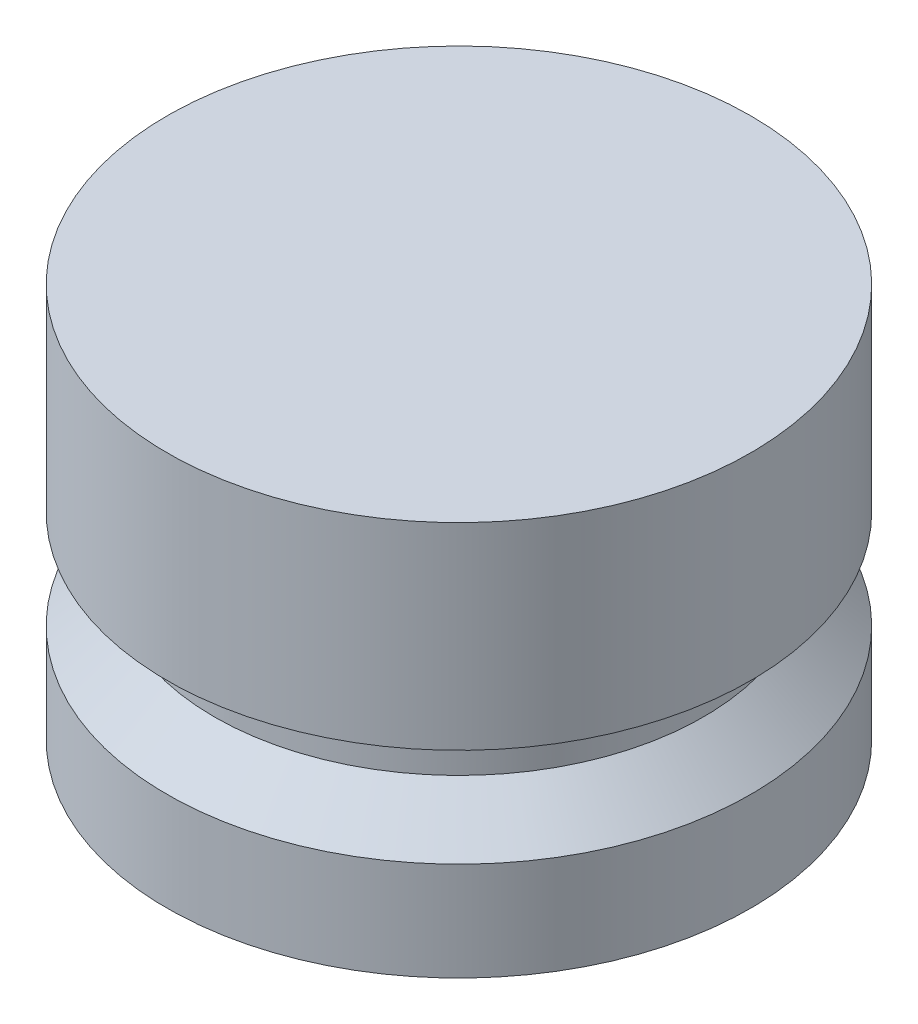
ISO-10303-21;
HEADER;
FILE_DESCRIPTION(('STEP AP214'),'2;1');
FILE_NAME('part.step','',(''),(''),'','','');
FILE_SCHEMA(('AUTOMOTIVE_DESIGN { 1 0 10303 214 1 1 1 1 }'));
ENDSEC;
DATA;
#1=APPLICATION_CONTEXT('core data for automotive mechanical design processes');
#2=APPLICATION_PROTOCOL_DEFINITION('international standard','automotive_design',2000,#1);
#3=PRODUCT_CONTEXT('',#1,'mechanical');
#4=PRODUCT('Part','Part','',(#3));
#5=PRODUCT_RELATED_PRODUCT_CATEGORY('part','',(#4));
#6=PRODUCT_DEFINITION_FORMATION('','',#4);
#7=PRODUCT_DEFINITION_CONTEXT('part definition',#1,'design');
#8=PRODUCT_DEFINITION('design','',#6,#7);
#9=PRODUCT_DEFINITION_SHAPE('','',#8);
#10=(LENGTH_UNIT() NAMED_UNIT(*) SI_UNIT(.MILLI.,.METRE.));
#11=(NAMED_UNIT(*) PLANE_ANGLE_UNIT() SI_UNIT($,.RADIAN.));
#12=(NAMED_UNIT(*) SI_UNIT($,.STERADIAN.) SOLID_ANGLE_UNIT());
#13=UNCERTAINTY_MEASURE_WITH_UNIT(LENGTH_MEASURE(1.E-05),#10,'distance_accuracy_value','');
#14=(GEOMETRIC_REPRESENTATION_CONTEXT(3) GLOBAL_UNCERTAINTY_ASSIGNED_CONTEXT((#13)) GLOBAL_UNIT_ASSIGNED_CONTEXT((#10,
#11,#12)) REPRESENTATION_CONTEXT('',''));
#15=CARTESIAN_POINT('',(0.,0.,0.));
#16=DIRECTION('',(0.,0.,1.));
#17=DIRECTION('',(1.,0.,0.));
#18=AXIS2_PLACEMENT_3D('',#15,#16,#17);
#19=CARTESIAN_POINT('',(0.,0.,0.));
#20=DIRECTION('',(0.,1.,0.));
#21=DIRECTION('',(0.,0.,1.));
#22=AXIS2_PLACEMENT_3D('',#19,#20,#21);
#23=PLANE('',#22);
#24=CARTESIAN_POINT('',(0.,0.,0.));
#25=DIRECTION('',(0.,-1.,0.));
#26=DIRECTION('',(0.,0.,-1.));
#27=AXIS2_PLACEMENT_3D('',#24,#25,#26);
#28=CIRCLE('',#27,9.398);
#29=CARTESIAN_POINT('',(0.,0.,-9.398));
#30=VERTEX_POINT('',#29);
#31=EDGE_CURVE('E10',#30,#30,#28,.T.);
#32=ORIENTED_EDGE('',*,*,#31,.T.);
#33=EDGE_LOOP('',(#32));
#34=FACE_BOUND('',#33,.T.);
#35=ADVANCED_FACE('F31',(#34),#23,.F.);
#36=CARTESIAN_POINT('',(0.,0.,0.));
#37=DIRECTION('',(0.,-1.,0.));
#38=DIRECTION('',(0.,0.,-1.));
#39=AXIS2_PLACEMENT_3D('',#36,#37,#38);
#40=CYLINDRICAL_SURFACE('',#39,9.398);
#41=ORIENTED_EDGE('',*,*,#31,.F.);
#42=EDGE_LOOP('',(#41));
#43=FACE_BOUND('',#42,.T.);
#44=CARTESIAN_POINT('',(0.,3.175,0.));
#45=DIRECTION('',(0.,-1.,0.));
#46=DIRECTION('',(0.,0.,-1.));
#47=AXIS2_PLACEMENT_3D('',#44,#45,#46);
#48=CIRCLE('',#47,9.398);
#49=CARTESIAN_POINT('',(0.,3.175,-9.398));
#50=VERTEX_POINT('',#49);
#51=EDGE_CURVE('E37',#50,#50,#48,.T.);
#52=ORIENTED_EDGE('',*,*,#51,.T.);
#53=EDGE_LOOP('',(#52));
#54=FACE_BOUND('',#53,.T.);
#55=ADVANCED_FACE('F69',(#43,#54),#40,.T.);
#56=CARTESIAN_POINT('',(0.,4.572,0.));
#57=DIRECTION('',(0.,-1.,0.));
#58=DIRECTION('',(0.,0.,-1.));
#59=AXIS2_PLACEMENT_3D('',#56,#57,#58);
#60=CONICAL_SURFACE('',#59,7.874,0.82884905878898);
#61=ORIENTED_EDGE('',*,*,#51,.F.);
#62=EDGE_LOOP('',(#61));
#63=FACE_BOUND('',#62,.T.);
#64=CARTESIAN_POINT('',(0.,4.572,0.));
#65=DIRECTION('',(0.,-1.,0.));
#66=DIRECTION('',(0.,0.,-1.));
#67=AXIS2_PLACEMENT_3D('',#64,#65,#66);
#68=CIRCLE('',#67,7.874);
#69=CARTESIAN_POINT('',(0.,4.572,-7.874));
#70=VERTEX_POINT('',#69);
#71=EDGE_CURVE('E41',#70,#70,#68,.T.);
#72=ORIENTED_EDGE('',*,*,#71,.T.);
#73=EDGE_LOOP('',(#72));
#74=FACE_BOUND('',#73,.T.);
#75=ADVANCED_FACE('F73',(#63,#74),#60,.T.);
#76=CARTESIAN_POINT('',(0.,0.,0.));
#77=DIRECTION('',(0.,-1.,0.));
#78=DIRECTION('',(0.,0.,-1.));
#79=AXIS2_PLACEMENT_3D('',#76,#77,#78);
#80=CYLINDRICAL_SURFACE('',#79,7.874);
#81=ORIENTED_EDGE('',*,*,#71,.F.);
#82=EDGE_LOOP('',(#81));
#83=FACE_BOUND('',#82,.T.);
#84=CARTESIAN_POINT('',(0.,6.35,0.));
#85=DIRECTION('',(0.,-1.,0.));
#86=DIRECTION('',(0.,0.,-1.));
#87=AXIS2_PLACEMENT_3D('',#84,#85,#86);
#88=CIRCLE('',#87,7.874);
#89=CARTESIAN_POINT('',(0.,6.35,-7.874));
#90=VERTEX_POINT('',#89);
#91=EDGE_CURVE('E45',#90,#90,#88,.T.);
#92=ORIENTED_EDGE('',*,*,#91,.T.);
#93=EDGE_LOOP('',(#92));
#94=FACE_BOUND('',#93,.T.);
#95=ADVANCED_FACE('F78',(#83,#94),#80,.T.);
#96=CARTESIAN_POINT('',(-7.874,6.35,0.));
#97=DIRECTION('',(0.,1.,0.));
#98=DIRECTION('',(0.,0.,1.));
#99=AXIS2_PLACEMENT_3D('',#96,#97,#98);
#100=PLANE('',#99);
#101=ORIENTED_EDGE('',*,*,#91,.F.);
#102=EDGE_LOOP('',(#101));
#103=FACE_BOUND('',#102,.T.);
#104=CARTESIAN_POINT('',(0.,6.35,0.));
#105=DIRECTION('',(0.,-1.,0.));
#106=DIRECTION('',(0.,0.,-1.));
#107=AXIS2_PLACEMENT_3D('',#104,#105,#106);
#108=CIRCLE('',#107,9.398);
#109=CARTESIAN_POINT('',(0.,6.35,-9.398));
#110=VERTEX_POINT('',#109);
#111=EDGE_CURVE('E50',#110,#110,#108,.T.);
#112=ORIENTED_EDGE('',*,*,#111,.T.);
#113=EDGE_LOOP('',(#112));
#114=FACE_BOUND('',#113,.T.);
#115=ADVANCED_FACE('F65',(#103,#114),#100,.F.);
#116=CARTESIAN_POINT('',(0.,0.,0.));
#117=DIRECTION('',(0.,-1.,0.));
#118=DIRECTION('',(0.,0.,-1.));
#119=AXIS2_PLACEMENT_3D('',#116,#117,#118);
#120=CYLINDRICAL_SURFACE('',#119,9.398);
#121=ORIENTED_EDGE('',*,*,#111,.F.);
#122=EDGE_LOOP('',(#121));
#123=FACE_BOUND('',#122,.T.);
#124=CARTESIAN_POINT('',(0.,12.7,0.));
#125=DIRECTION('',(0.,-1.,0.));
#126=DIRECTION('',(0.,0.,-1.));
#127=AXIS2_PLACEMENT_3D('',#124,#125,#126);
#128=CIRCLE('',#127,9.398);
#129=CARTESIAN_POINT('',(0.,12.7,-9.398));
#130=VERTEX_POINT('',#129);
#131=EDGE_CURVE('E53',#130,#130,#128,.T.);
#132=ORIENTED_EDGE('',*,*,#131,.T.);
#133=EDGE_LOOP('',(#132));
#134=FACE_BOUND('',#133,.T.);
#135=ADVANCED_FACE('F57',(#123,#134),#120,.T.);
#136=CARTESIAN_POINT('',(-9.398,12.7,0.));
#137=DIRECTION('',(0.,-1.,0.));
#138=DIRECTION('',(0.,0.,-1.));
#139=AXIS2_PLACEMENT_3D('',#136,#137,#138);
#140=PLANE('',#139);
#141=ORIENTED_EDGE('',*,*,#131,.F.);
#142=EDGE_LOOP('',(#141));
#143=FACE_BOUND('',#142,.T.);
#144=ADVANCED_FACE('F59',(#143),#140,.F.);
#145=CLOSED_SHELL('',(#35,#55,#75,#95,#115,#135,#144));
#146=MANIFOLD_SOLID_BREP('B2',#145);
#147=ADVANCED_BREP_SHAPE_REPRESENTATION('',(#18,#146),#14);
#148=SHAPE_DEFINITION_REPRESENTATION(#9,#147);
ENDSEC;
END-ISO-10303-21;
